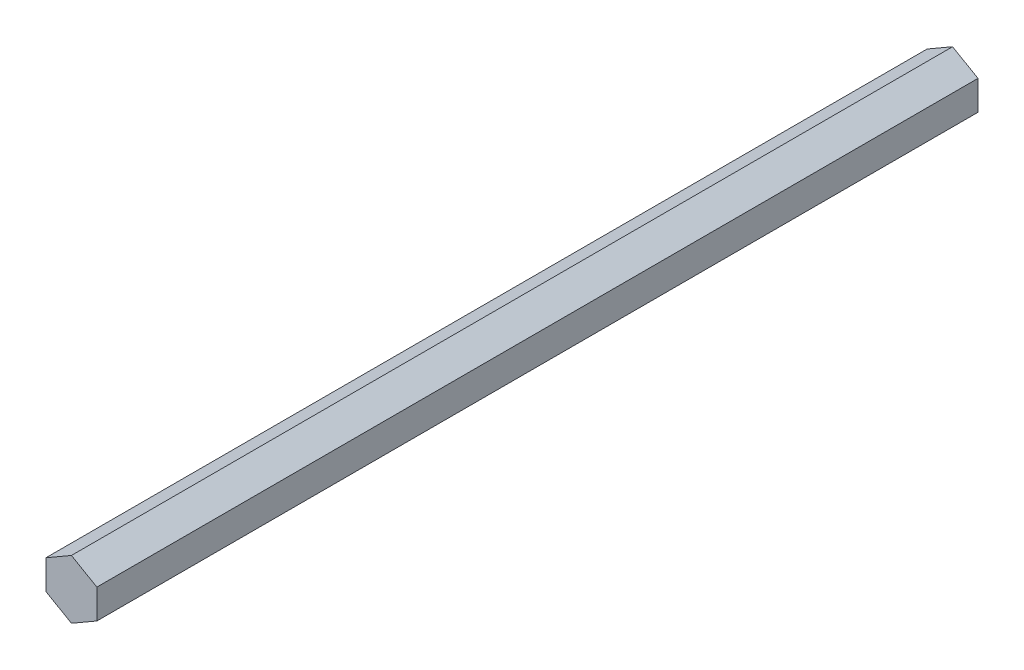
ISO-10303-21;
HEADER;
FILE_DESCRIPTION(('STEP AP214'),'2;1');
FILE_NAME('part.step','',(''),(''),'','','');
FILE_SCHEMA(('AUTOMOTIVE_DESIGN { 1 0 10303 214 1 1 1 1 }'));
ENDSEC;
DATA;
#1=APPLICATION_CONTEXT('core data for automotive mechanical design processes');
#2=APPLICATION_PROTOCOL_DEFINITION('international standard','automotive_design',2000,#1);
#3=PRODUCT_CONTEXT('',#1,'mechanical');
#4=PRODUCT('Part','Part','',(#3));
#5=PRODUCT_RELATED_PRODUCT_CATEGORY('part','',(#4));
#6=PRODUCT_DEFINITION_FORMATION('','',#4);
#7=PRODUCT_DEFINITION_CONTEXT('part definition',#1,'design');
#8=PRODUCT_DEFINITION('design','',#6,#7);
#9=PRODUCT_DEFINITION_SHAPE('','',#8);
#10=(LENGTH_UNIT() NAMED_UNIT(*) SI_UNIT(.MILLI.,.METRE.));
#11=(NAMED_UNIT(*) PLANE_ANGLE_UNIT() SI_UNIT($,.RADIAN.));
#12=(NAMED_UNIT(*) SI_UNIT($,.STERADIAN.) SOLID_ANGLE_UNIT());
#13=UNCERTAINTY_MEASURE_WITH_UNIT(LENGTH_MEASURE(1.E-05),#10,'distance_accuracy_value','');
#14=(GEOMETRIC_REPRESENTATION_CONTEXT(3) GLOBAL_UNCERTAINTY_ASSIGNED_CONTEXT((#13)) GLOBAL_UNIT_ASSIGNED_CONTEXT((#10,
#11,#12)) REPRESENTATION_CONTEXT('',''));
#15=CARTESIAN_POINT('',(0.,0.,0.));
#16=DIRECTION('',(0.,0.,1.));
#17=DIRECTION('',(1.,0.,0.));
#18=AXIS2_PLACEMENT_3D('',#15,#16,#17);
#19=CARTESIAN_POINT('',(6.34999999999996,3.6661742093542,220.));
#20=DIRECTION('',(-0.499999999999995,-0.866025403784442,0.));
#21=DIRECTION('',(0.866025403784442,-0.499999999999995,0.));
#22=AXIS2_PLACEMENT_3D('',#19,#20,#21);
#23=PLANE('',#22);
#24=DIRECTION('',(-0.866025403784442,0.499999999999995,0.));
#25=VECTOR('',#24,1.);
#26=CARTESIAN_POINT('',(6.34999999999996,3.6661742093542,0.));
#27=LINE('',#26,#25);
#28=CARTESIAN_POINT('',(6.34999999999996,3.6661742093542,0.));
#29=VERTEX_POINT('',#28);
#30=CARTESIAN_POINT('',(0.,7.33234841870825,0.));
#31=VERTEX_POINT('',#30);
#32=EDGE_CURVE('E121',#29,#31,#27,.T.);
#33=ORIENTED_EDGE('',*,*,#32,.T.);
#34=DIRECTION('',(0.,0.,-1.));
#35=VECTOR('',#34,1.);
#36=CARTESIAN_POINT('',(0.,7.33234841870825,220.));
#37=LINE('',#36,#35);
#38=CARTESIAN_POINT('',(0.,7.33234841870825,220.));
#39=VERTEX_POINT('',#38);
#40=EDGE_CURVE('E11',#39,#31,#37,.T.);
#41=ORIENTED_EDGE('',*,*,#40,.F.);
#42=DIRECTION('',(-0.866025403784442,0.499999999999995,0.));
#43=VECTOR('',#42,1.);
#44=CARTESIAN_POINT('',(6.34999999999996,3.6661742093542,220.));
#45=LINE('',#44,#43);
#46=CARTESIAN_POINT('',(6.34999999999996,3.6661742093542,220.));
#47=VERTEX_POINT('',#46);
#48=EDGE_CURVE('E133',#47,#39,#45,.T.);
#49=ORIENTED_EDGE('',*,*,#48,.F.);
#50=DIRECTION('',(0.,0.,-1.));
#51=VECTOR('',#50,1.);
#52=CARTESIAN_POINT('',(6.34999999999996,3.6661742093542,220.));
#53=LINE('',#52,#51);
#54=EDGE_CURVE('E116',#47,#29,#53,.T.);
#55=ORIENTED_EDGE('',*,*,#54,.T.);
#56=EDGE_LOOP('',(#33,#41,#49,#55));
#57=FACE_BOUND('',#56,.T.);
#58=ADVANCED_FACE('F39',(#57),#23,.F.);
#59=CARTESIAN_POINT('',(0.,7.33234841870825,220.));
#60=DIRECTION('',(0.500000000000001,-0.866025403784438,0.));
#61=DIRECTION('',(0.866025403784438,0.500000000000001,0.));
#62=AXIS2_PLACEMENT_3D('',#59,#60,#61);
#63=PLANE('',#62);
#64=DIRECTION('',(-0.866025403784438,-0.500000000000001,0.));
#65=VECTOR('',#64,1.);
#66=CARTESIAN_POINT('',(0.,7.33234841870825,0.));
#67=LINE('',#66,#65);
#68=CARTESIAN_POINT('',(-6.35000000000001,3.66617420935411,0.));
#69=VERTEX_POINT('',#68);
#70=EDGE_CURVE('E128',#31,#69,#67,.T.);
#71=ORIENTED_EDGE('',*,*,#70,.T.);
#72=DIRECTION('',(0.,0.,-1.));
#73=VECTOR('',#72,1.);
#74=CARTESIAN_POINT('',(-6.35000000000001,3.66617420935411,220.));
#75=LINE('',#74,#73);
#76=CARTESIAN_POINT('',(-6.35000000000001,3.66617420935411,220.));
#77=VERTEX_POINT('',#76);
#78=EDGE_CURVE('E50',#77,#69,#75,.T.);
#79=ORIENTED_EDGE('',*,*,#78,.F.);
#80=DIRECTION('',(-0.866025403784438,-0.500000000000001,0.));
#81=VECTOR('',#80,1.);
#82=CARTESIAN_POINT('',(0.,7.33234841870825,220.));
#83=LINE('',#82,#81);
#84=EDGE_CURVE('E95',#39,#77,#83,.T.);
#85=ORIENTED_EDGE('',*,*,#84,.F.);
#86=ORIENTED_EDGE('',*,*,#40,.T.);
#87=EDGE_LOOP('',(#71,#79,#85,#86));
#88=FACE_BOUND('',#87,.T.);
#89=ADVANCED_FACE('F160',(#88),#63,.F.);
#90=CARTESIAN_POINT('',(-6.35000000000001,3.66617420935411,220.));
#91=DIRECTION('',(1.,0.,0.));
#92=DIRECTION('',(0.,1.,0.));
#93=AXIS2_PLACEMENT_3D('',#90,#91,#92);
#94=PLANE('',#93);
#95=DIRECTION('',(0.,-1.,0.));
#96=VECTOR('',#95,1.);
#97=CARTESIAN_POINT('',(-6.35000000000001,3.66617420935411,0.));
#98=LINE('',#97,#96);
#99=CARTESIAN_POINT('',(-6.34999999999998,-3.66617420935415,0.));
#100=VERTEX_POINT('',#99);
#101=EDGE_CURVE('E126',#69,#100,#98,.T.);
#102=ORIENTED_EDGE('',*,*,#101,.T.);
#103=DIRECTION('',(0.,0.,-1.));
#104=VECTOR('',#103,1.);
#105=CARTESIAN_POINT('',(-6.34999999999998,-3.66617420935415,220.));
#106=LINE('',#105,#104);
#107=CARTESIAN_POINT('',(-6.34999999999998,-3.66617420935415,220.));
#108=VERTEX_POINT('',#107);
#109=EDGE_CURVE('E114',#108,#100,#106,.T.);
#110=ORIENTED_EDGE('',*,*,#109,.F.);
#111=DIRECTION('',(0.,-1.,0.));
#112=VECTOR('',#111,1.);
#113=CARTESIAN_POINT('',(-6.35000000000001,3.66617420935411,220.));
#114=LINE('',#113,#112);
#115=EDGE_CURVE('E103',#77,#108,#114,.T.);
#116=ORIENTED_EDGE('',*,*,#115,.F.);
#117=ORIENTED_EDGE('',*,*,#78,.T.);
#118=EDGE_LOOP('',(#102,#110,#116,#117));
#119=FACE_BOUND('',#118,.T.);
#120=ADVANCED_FACE('F137',(#119),#94,.F.);
#121=CARTESIAN_POINT('',(-6.34999999999998,-3.66617420935415,220.));
#122=DIRECTION('',(0.499999999999995,0.866025403784442,0.));
#123=DIRECTION('',(-0.866025403784442,0.499999999999995,0.));
#124=AXIS2_PLACEMENT_3D('',#121,#122,#123);
#125=PLANE('',#124);
#126=DIRECTION('',(0.866025403784442,-0.499999999999995,0.));
#127=VECTOR('',#126,1.);
#128=CARTESIAN_POINT('',(-6.34999999999998,-3.66617420935415,0.));
#129=LINE('',#128,#127);
#130=CARTESIAN_POINT('',(0.,-7.33234841870824,0.));
#131=VERTEX_POINT('',#130);
#132=EDGE_CURVE('E111',#100,#131,#129,.T.);
#133=ORIENTED_EDGE('',*,*,#132,.T.);
#134=DIRECTION('',(0.,0.,-1.));
#135=VECTOR('',#134,1.);
#136=CARTESIAN_POINT('',(0.,-7.33234841870824,220.));
#137=LINE('',#136,#135);
#138=CARTESIAN_POINT('',(0.,-7.33234841870824,220.));
#139=VERTEX_POINT('',#138);
#140=EDGE_CURVE('E108',#139,#131,#137,.T.);
#141=ORIENTED_EDGE('',*,*,#140,.F.);
#142=DIRECTION('',(0.866025403784442,-0.499999999999995,0.));
#143=VECTOR('',#142,1.);
#144=CARTESIAN_POINT('',(-6.34999999999998,-3.66617420935415,220.));
#145=LINE('',#144,#143);
#146=EDGE_CURVE('E98',#108,#139,#145,.T.);
#147=ORIENTED_EDGE('',*,*,#146,.F.);
#148=ORIENTED_EDGE('',*,*,#109,.T.);
#149=EDGE_LOOP('',(#133,#141,#147,#148));
#150=FACE_BOUND('',#149,.T.);
#151=ADVANCED_FACE('F112',(#150),#125,.F.);
#152=CARTESIAN_POINT('',(0.,-7.33234841870824,220.));
#153=DIRECTION('',(-0.500000000000007,0.866025403784435,0.));
#154=DIRECTION('',(-0.866025403784435,-0.500000000000007,0.));
#155=AXIS2_PLACEMENT_3D('',#152,#153,#154);
#156=PLANE('',#155);
#157=DIRECTION('',(0.866025403784434,0.500000000000007,0.));
#158=VECTOR('',#157,1.);
#159=CARTESIAN_POINT('',(0.,-7.33234841870824,0.));
#160=LINE('',#159,#158);
#161=CARTESIAN_POINT('',(6.35000000000003,-3.66617420935406,0.));
#162=VERTEX_POINT('',#161);
#163=EDGE_CURVE('E76',#131,#162,#160,.T.);
#164=ORIENTED_EDGE('',*,*,#163,.T.);
#165=DIRECTION('',(0.,0.,-1.));
#166=VECTOR('',#165,1.);
#167=CARTESIAN_POINT('',(6.35000000000003,-3.66617420935406,220.));
#168=LINE('',#167,#166);
#169=CARTESIAN_POINT('',(6.35000000000003,-3.66617420935406,220.));
#170=VERTEX_POINT('',#169);
#171=EDGE_CURVE('E113',#170,#162,#168,.T.);
#172=ORIENTED_EDGE('',*,*,#171,.F.);
#173=DIRECTION('',(0.866025403784434,0.500000000000007,0.));
#174=VECTOR('',#173,1.);
#175=CARTESIAN_POINT('',(0.,-7.33234841870824,220.));
#176=LINE('',#175,#174);
#177=EDGE_CURVE('E104',#139,#170,#176,.T.);
#178=ORIENTED_EDGE('',*,*,#177,.F.);
#179=ORIENTED_EDGE('',*,*,#140,.T.);
#180=EDGE_LOOP('',(#164,#172,#178,#179));
#181=FACE_BOUND('',#180,.T.);
#182=ADVANCED_FACE('F119',(#181),#156,.F.);
#183=CARTESIAN_POINT('',(6.35000000000003,-3.66617420935406,220.));
#184=DIRECTION('',(-1.,0.,0.));
#185=DIRECTION('',(0.,-1.,0.));
#186=AXIS2_PLACEMENT_3D('',#183,#184,#185);
#187=PLANE('',#186);
#188=DIRECTION('',(0.,1.,0.));
#189=VECTOR('',#188,1.);
#190=CARTESIAN_POINT('',(6.35000000000003,-3.66617420935406,0.));
#191=LINE('',#190,#189);
#192=EDGE_CURVE('E84',#162,#29,#191,.T.);
#193=ORIENTED_EDGE('',*,*,#192,.T.);
#194=ORIENTED_EDGE('',*,*,#54,.F.);
#195=DIRECTION('',(0.,1.,0.));
#196=VECTOR('',#195,1.);
#197=CARTESIAN_POINT('',(6.35000000000003,-3.66617420935406,220.));
#198=LINE('',#197,#196);
#199=EDGE_CURVE('E54',#170,#47,#198,.T.);
#200=ORIENTED_EDGE('',*,*,#199,.F.);
#201=ORIENTED_EDGE('',*,*,#171,.T.);
#202=EDGE_LOOP('',(#193,#194,#200,#201));
#203=FACE_BOUND('',#202,.T.);
#204=ADVANCED_FACE('F147',(#203),#187,.F.);
#205=CARTESIAN_POINT('',(0.,0.,220.));
#206=DIRECTION('',(0.,0.,1.));
#207=DIRECTION('',(1.,0.,0.));
#208=AXIS2_PLACEMENT_3D('',#205,#206,#207);
#209=PLANE('',#208);
#210=ORIENTED_EDGE('',*,*,#48,.T.);
#211=ORIENTED_EDGE('',*,*,#84,.T.);
#212=ORIENTED_EDGE('',*,*,#115,.T.);
#213=ORIENTED_EDGE('',*,*,#146,.T.);
#214=ORIENTED_EDGE('',*,*,#177,.T.);
#215=ORIENTED_EDGE('',*,*,#199,.T.);
#216=EDGE_LOOP('',(#210,#211,#212,#213,#214,#215));
#217=FACE_BOUND('',#216,.T.);
#218=ADVANCED_FACE('F102',(#217),#209,.T.);
#219=CARTESIAN_POINT('',(0.,0.,0.));
#220=DIRECTION('',(0.,0.,1.));
#221=DIRECTION('',(1.,0.,0.));
#222=AXIS2_PLACEMENT_3D('',#219,#220,#221);
#223=PLANE('',#222);
#224=ORIENTED_EDGE('',*,*,#32,.F.);
#225=ORIENTED_EDGE('',*,*,#192,.F.);
#226=ORIENTED_EDGE('',*,*,#163,.F.);
#227=ORIENTED_EDGE('',*,*,#132,.F.);
#228=ORIENTED_EDGE('',*,*,#101,.F.);
#229=ORIENTED_EDGE('',*,*,#70,.F.);
#230=EDGE_LOOP('',(#224,#225,#226,#227,#228,#229));
#231=FACE_BOUND('',#230,.T.);
#232=ADVANCED_FACE('F145',(#231),#223,.F.);
#233=CLOSED_SHELL('',(#58,#89,#120,#151,#182,#204,#218,#232));
#234=MANIFOLD_SOLID_BREP('B2',#233);
#235=ADVANCED_BREP_SHAPE_REPRESENTATION('',(#18,#234),#14);
#236=SHAPE_DEFINITION_REPRESENTATION(#9,#235);
ENDSEC;
END-ISO-10303-21;
